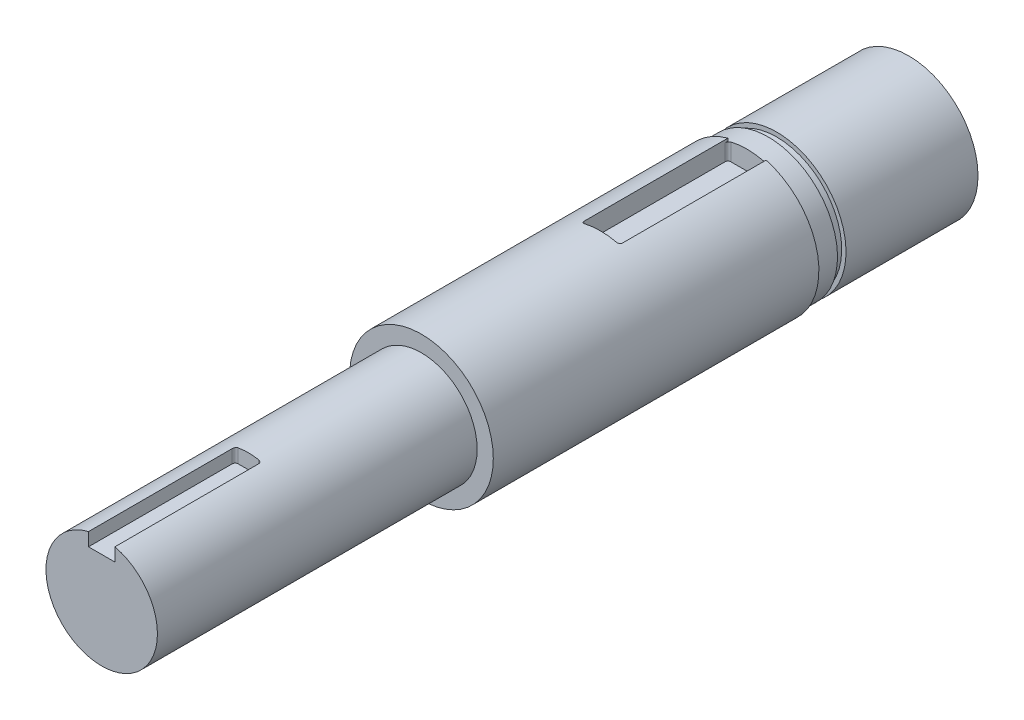
ISO-10303-21;
HEADER;
FILE_DESCRIPTION(('STEP AP214'),'2;1');
FILE_NAME('part.step','',(''),(''),'','','');
FILE_SCHEMA(('AUTOMOTIVE_DESIGN { 1 0 10303 214 1 1 1 1 }'));
ENDSEC;
DATA;
#1=APPLICATION_CONTEXT('core data for automotive mechanical design processes');
#2=APPLICATION_PROTOCOL_DEFINITION('international standard','automotive_design',2000,#1);
#3=PRODUCT_CONTEXT('',#1,'mechanical');
#4=PRODUCT('Part','Part','',(#3));
#5=PRODUCT_RELATED_PRODUCT_CATEGORY('part','',(#4));
#6=PRODUCT_DEFINITION_FORMATION('','',#4);
#7=PRODUCT_DEFINITION_CONTEXT('part definition',#1,'design');
#8=PRODUCT_DEFINITION('design','',#6,#7);
#9=PRODUCT_DEFINITION_SHAPE('','',#8);
#10=(LENGTH_UNIT() NAMED_UNIT(*) SI_UNIT(.MILLI.,.METRE.));
#11=(NAMED_UNIT(*) PLANE_ANGLE_UNIT() SI_UNIT($,.RADIAN.));
#12=(NAMED_UNIT(*) SI_UNIT($,.STERADIAN.) SOLID_ANGLE_UNIT());
#13=UNCERTAINTY_MEASURE_WITH_UNIT(LENGTH_MEASURE(1.E-05),#10,'distance_accuracy_value','');
#14=(GEOMETRIC_REPRESENTATION_CONTEXT(3) GLOBAL_UNCERTAINTY_ASSIGNED_CONTEXT((#13)) GLOBAL_UNIT_ASSIGNED_CONTEXT((#10,
#11,#12)) REPRESENTATION_CONTEXT('',''));
#15=CARTESIAN_POINT('',(0.,0.,0.));
#16=DIRECTION('',(0.,0.,1.));
#17=DIRECTION('',(1.,0.,0.));
#18=AXIS2_PLACEMENT_3D('',#15,#16,#17);
#19=CARTESIAN_POINT('',(0.,0.,28.194));
#20=DIRECTION('',(0.,0.,-1.));
#21=DIRECTION('',(-1.,0.,0.));
#22=AXIS2_PLACEMENT_3D('',#19,#20,#21);
#23=CYLINDRICAL_SURFACE('',#22,6.223);
#24=CARTESIAN_POINT('',(0.,0.,0.));
#25=DIRECTION('',(0.,0.,1.));
#26=DIRECTION('',(1.,0.,0.));
#27=AXIS2_PLACEMENT_3D('',#24,#25,#26);
#28=CIRCLE('',#27,6.223);
#29=CARTESIAN_POINT('',(-1.651,5.999993999997,0.));
#30=VERTEX_POINT('',#29);
#31=CARTESIAN_POINT('',(1.651,5.999993999997,0.));
#32=VERTEX_POINT('',#31);
#33=EDGE_CURVE('E174',#30,#32,#28,.T.);
#34=ORIENTED_EDGE('',*,*,#33,.T.);
#35=DIRECTION('',(0.,0.,-1.));
#36=VECTOR('',#35,1.);
#37=CARTESIAN_POINT('',(1.651,5.999993999997,28.194));
#38=LINE('',#37,#36);
#39=CARTESIAN_POINT('',(1.651,5.999993999997,12.446));
#40=VERTEX_POINT('',#39);
#41=EDGE_CURVE('E221',#32,#40,#38,.F.);
#42=ORIENTED_EDGE('',*,*,#41,.T.);
#43=CARTESIAN_POINT('',(1.651,5.999993999997,12.446));
#44=CARTESIAN_POINT('',(1.65101365911319,5.99998885600186,12.4599371532582));
#45=CARTESIAN_POINT('',(1.64985379408889,6.00030938344019,12.473867225153));
#46=CARTESIAN_POINT('',(1.64529192026899,6.00156258454862,12.5013011630621));
#47=CARTESIAN_POINT('',(1.64189411683366,6.00249411006495,12.514805778784));
#48=CARTESIAN_POINT('',(1.63296019772344,6.00493047717273,12.5410329475935));
#49=CARTESIAN_POINT('',(1.62742390823833,6.00643536536539,12.5537554370146));
#50=CARTESIAN_POINT('',(1.61439639075044,6.00994999603842,12.5780798810677));
#51=CARTESIAN_POINT('',(1.60690488308525,6.01195981073884,12.5896816750768));
#52=CARTESIAN_POINT('',(1.59005297817903,6.01643893737926,12.6116547380317));
#53=CARTESIAN_POINT('',(1.58066333766302,6.01891539200831,12.6220020993992));
#54=CARTESIAN_POINT('',(1.56037002430933,6.02420818200575,12.6409855630794));
#55=CARTESIAN_POINT('',(1.54946594231671,6.02702460919715,12.6496212014024));
#56=CARTESIAN_POINT('',(1.52606255784957,6.03299365715654,12.6652332823865));
#57=CARTESIAN_POINT('',(1.51352242704203,6.03615431562268,12.6721454129126));
#58=CARTESIAN_POINT('',(1.48749417753383,6.04262109166117,12.6837598850571));
#59=CARTESIAN_POINT('',(1.47400630082956,6.0459271720216,12.6884627884369));
#60=CARTESIAN_POINT('',(1.44990836609661,6.0517441617669,12.6946571828533));
#61=CARTESIAN_POINT('',(1.43942410890025,6.05424673157387,12.6966580963021));
#62=CARTESIAN_POINT('',(1.41829673705527,6.05923119850961,12.6993296549334));
#63=CARTESIAN_POINT('',(1.40765383682191,6.06171311752701,12.7000019559701));
#64=CARTESIAN_POINT('',(1.397,6.06416688424717,12.7));
#65=B_SPLINE_CURVE_WITH_KNOTS('',3,(#43,#44,#45,#46,#47,#48,#49,#50,#51,#52,#53,#54,#55,#56,#57,
#58,#59,#60,#61,#62,#63,#64),.UNSPECIFIED.,.F.,.F.,(4,2,2,2,2,2,2,2,2,2,4),(0.,
0.0417488156054148,0.0834194030451653,0.125093378067803,0.166773317150151,0.209152456981566,
0.251543068690232,0.295335507240235,0.339116804228455,0.371927199746421,0.40469667770493),.UNSPECIFIED.);
#66=CARTESIAN_POINT('',(1.397,6.06416688424717,12.7));
#67=VERTEX_POINT('',#66);
#68=EDGE_CURVE('E320',#40,#67,#65,.T.);
#69=ORIENTED_EDGE('',*,*,#68,.T.);
#70=CARTESIAN_POINT('',(0.,0.,12.7));
#71=DIRECTION('',(0.,0.,-1.));
#72=DIRECTION('',(-1.,0.,0.));
#73=AXIS2_PLACEMENT_3D('',#70,#71,#72);
#74=CIRCLE('',#73,6.223);
#75=CARTESIAN_POINT('',(-1.397,6.06416688424717,12.7));
#76=VERTEX_POINT('',#75);
#77=EDGE_CURVE('E242',#76,#67,#74,.T.);
#78=ORIENTED_EDGE('',*,*,#77,.F.);
#79=CARTESIAN_POINT('',(-1.397,6.06416688424717,12.7));
#80=CARTESIAN_POINT('',(-1.41165090529352,6.06079390642007,12.700010270971));
#81=CARTESIAN_POINT('',(-1.42628522450905,6.05736460837732,12.6987330395745));
#82=CARTESIAN_POINT('',(-1.45511557715207,6.05050247974281,12.69369188033));
#83=CARTESIAN_POINT('',(-1.46931169749558,6.04706964999295,12.6899284489764));
#84=CARTESIAN_POINT('',(-1.49687397781058,6.04030634903221,12.6800005140272));
#85=CARTESIAN_POINT('',(-1.51023969599947,6.03697593277421,12.6738347448327));
#86=CARTESIAN_POINT('',(-1.53574481264174,6.03053807691927,12.659263665385));
#87=CARTESIAN_POINT('',(-1.54788455576024,6.02743057472483,12.6508589869994));
#88=CARTESIAN_POINT('',(-1.57048207326345,6.02158206406083,12.6321017576408));
#89=CARTESIAN_POINT('',(-1.58095273326457,6.01883827849694,12.6217656175073));
#90=CARTESIAN_POINT('',(-1.59999919464336,6.0138031951122,12.5993729634366));
#91=CARTESIAN_POINT('',(-1.60857481888172,6.01151193959392,12.587316288845));
#92=CARTESIAN_POINT('',(-1.62332418480107,6.0075456300982,12.5621883274646));
#93=CARTESIAN_POINT('',(-1.62955873906087,6.00585504693318,12.549155151668));
#94=CARTESIAN_POINT('',(-1.63973781672755,6.00308395845329,12.5221690940492));
#95=CARTESIAN_POINT('',(-1.64368485486539,6.00200278323511,12.5082172410241));
#96=CARTESIAN_POINT('',(-1.64794141373288,6.00083497827377,12.4861186857271));
#97=CARTESIAN_POINT('',(-1.64908770036319,6.00051995801422,12.4781359369184));
#98=CARTESIAN_POINT('',(-1.65061671687385,6.0000994744892,12.4621034918921));
#99=CARTESIAN_POINT('',(-1.65100051257264,5.99999371871231,12.4540539049398));
#100=CARTESIAN_POINT('',(-1.65100000000012,5.99999399999709,12.446));
#101=B_SPLINE_CURVE_WITH_KNOTS('',3,(#79,#80,#81,#82,#83,#84,#85,#86,#87,#88,#89,#90,#91,#92,
#93,#94,#95,#96,#97,#98,#99,#100),.UNSPECIFIED.,.F.,.F.,(4,2,2,2,2,2,2,2,2,2,4),(0.,
0.0450436059598747,0.0900782194225987,0.135136590154682,0.180182257906668,0.224861291388814,
0.269544499498677,0.312969989332677,0.356347649301799,0.380524910361107,0.404668352327528),.UNSPECIFIED.);
#102=CARTESIAN_POINT('',(-1.651,5.999993999997,12.446));
#103=VERTEX_POINT('',#102);
#104=EDGE_CURVE('E327',#76,#103,#101,.T.);
#105=ORIENTED_EDGE('',*,*,#104,.T.);
#106=DIRECTION('',(0.,0.,-1.));
#107=VECTOR('',#106,1.);
#108=CARTESIAN_POINT('',(-1.651,5.999993999997,28.194));
#109=LINE('',#108,#107);
#110=EDGE_CURVE('E217',#103,#30,#109,.T.);
#111=ORIENTED_EDGE('',*,*,#110,.T.);
#112=EDGE_LOOP('',(#34,#42,#69,#78,#105,#111));
#113=FACE_BOUND('',#112,.T.);
#114=CARTESIAN_POINT('',(0.,0.,28.194));
#115=DIRECTION('',(0.,0.,1.));
#116=DIRECTION('',(1.,0.,0.));
#117=AXIS2_PLACEMENT_3D('',#114,#115,#116);
#118=CIRCLE('',#117,6.223);
#119=CARTESIAN_POINT('',(6.223,0.,28.194));
#120=VERTEX_POINT('',#119);
#121=EDGE_CURVE('E232',#120,#120,#118,.T.);
#122=ORIENTED_EDGE('',*,*,#121,.F.);
#123=EDGE_LOOP('',(#122));
#124=FACE_BOUND('',#123,.T.);
#125=ADVANCED_FACE('F35',(#113,#124),#23,.T.);
#126=CARTESIAN_POINT('',(0.,0.,28.194));
#127=DIRECTION('',(0.,0.,1.));
#128=DIRECTION('',(1.,0.,0.));
#129=AXIS2_PLACEMENT_3D('',#126,#127,#128);
#130=PLANE('',#129);
#131=CARTESIAN_POINT('',(0.,0.,28.194));
#132=DIRECTION('',(0.,0.,1.));
#133=DIRECTION('',(1.,0.,0.));
#134=AXIS2_PLACEMENT_3D('',#131,#132,#133);
#135=CIRCLE('',#134,4.826);
#136=CARTESIAN_POINT('',(4.826,0.,28.194));
#137=VERTEX_POINT('',#136);
#138=EDGE_CURVE('E235',#137,#137,#135,.T.);
#139=ORIENTED_EDGE('',*,*,#138,.F.);
#140=EDGE_LOOP('',(#139));
#141=FACE_BOUND('',#140,.T.);
#142=ORIENTED_EDGE('',*,*,#121,.T.);
#143=EDGE_LOOP('',(#142));
#144=FACE_BOUND('',#143,.T.);
#145=ADVANCED_FACE('F310',(#141,#144),#130,.T.);
#146=CARTESIAN_POINT('',(0.,0.,0.));
#147=DIRECTION('',(0.,0.,1.));
#148=DIRECTION('',(1.,0.,0.));
#149=AXIS2_PLACEMENT_3D('',#146,#147,#148);
#150=PLANE('',#149);
#151=CARTESIAN_POINT('',(0.,0.,0.));
#152=DIRECTION('',(0.,0.,-1.));
#153=DIRECTION('',(0.,1.,0.));
#154=AXIS2_PLACEMENT_3D('',#151,#152,#153);
#155=CIRCLE('',#154,6.);
#156=CARTESIAN_POINT('',(1.651,5.76837923510582,0.));
#157=VERTEX_POINT('',#156);
#158=CARTESIAN_POINT('',(-1.651,5.76837923510582,0.));
#159=VERTEX_POINT('',#158);
#160=EDGE_CURVE('E172',#157,#159,#155,.T.);
#161=ORIENTED_EDGE('',*,*,#160,.F.);
#162=DIRECTION('',(0.,-1.,0.));
#163=VECTOR('',#162,1.);
#164=CARTESIAN_POINT('',(1.651,7.650993999997,0.));
#165=LINE('',#164,#163);
#166=EDGE_CURVE('E207',#32,#157,#165,.T.);
#167=ORIENTED_EDGE('',*,*,#166,.F.);
#168=ORIENTED_EDGE('',*,*,#33,.F.);
#169=DIRECTION('',(0.,1.,0.));
#170=VECTOR('',#169,1.);
#171=CARTESIAN_POINT('',(-1.651,7.650993999997,0.));
#172=LINE('',#171,#170);
#173=EDGE_CURVE('E161',#159,#30,#172,.T.);
#174=ORIENTED_EDGE('',*,*,#173,.F.);
#175=EDGE_LOOP('',(#161,#167,#168,#174));
#176=FACE_BOUND('',#175,.T.);
#177=ADVANCED_FACE('F170',(#176),#150,.F.);
#178=CARTESIAN_POINT('',(0.,0.,23.114));
#179=DIRECTION('',(0.,0.,1.));
#180=DIRECTION('',(1.,0.,0.));
#181=AXIS2_PLACEMENT_3D('',#178,#179,#180);
#182=CYLINDRICAL_SURFACE('',#181,4.826);
#183=DIRECTION('',(0.,0.,1.));
#184=VECTOR('',#183,1.);
#185=CARTESIAN_POINT('',(-1.143,4.68869139526158,23.114));
#186=LINE('',#185,#184);
#187=CARTESIAN_POINT('',(-1.143,4.68869139526158,43.434));
#188=VERTEX_POINT('',#187);
#189=CARTESIAN_POINT('',(-1.143,4.68869139526158,55.88));
#190=VERTEX_POINT('',#189);
#191=EDGE_CURVE('E227',#188,#190,#186,.T.);
#192=ORIENTED_EDGE('',*,*,#191,.F.);
#193=CARTESIAN_POINT('',(-1.143,4.68869139526158,43.434));
#194=CARTESIAN_POINT('',(-1.14301334199993,4.68868635098659,43.4199846123739));
#195=CARTESIAN_POINT('',(-1.14184084717489,4.68897395076386,43.405975753492));
#196=CARTESIAN_POINT('',(-1.13722613335057,4.69009624376878,43.3783828223305));
#197=CARTESIAN_POINT('',(-1.13378773922777,4.69093001503553,43.3647980745478));
#198=CARTESIAN_POINT('',(-1.12474188821357,4.69310685198262,43.3384133417774));
#199=CARTESIAN_POINT('',(-1.11913411151888,4.69444999275197,43.3256134728165));
#200=CARTESIAN_POINT('',(-1.10592986287992,4.69757823944377,43.3011443194648));
#201=CARTESIAN_POINT('',(-1.09833320849085,4.6993633859117,43.2894751389296));
#202=CARTESIAN_POINT('',(-1.08125807646762,4.70332164743461,43.2674163947149));
#203=CARTESIAN_POINT('',(-1.07175496981913,4.70549979807583,43.2570468141734));
#204=CARTESIAN_POINT('',(-1.05120709480351,4.71013273894259,43.238038753288));
#205=CARTESIAN_POINT('',(-1.04016191879112,4.71258760228383,43.2294007321565));
#206=CARTESIAN_POINT('',(-1.01653324617878,4.71774161161798,43.2138721370442));
#207=CARTESIAN_POINT('',(-1.00391749021795,4.72044541666509,43.207032222388));
#208=CARTESIAN_POINT('',(-0.977733886753047,4.72593811465772,43.1955753445258));
#209=CARTESIAN_POINT('',(-0.964166399743517,4.72872697516229,43.1909575447861));
#210=CARTESIAN_POINT('',(-0.940294692147358,4.73352155502814,43.1850189642204));
#211=CARTESIAN_POINT('',(-0.930126380668296,4.73553043040085,43.1831394348262));
#212=CARTESIAN_POINT('',(-0.909642261587015,4.73950810987208,43.1806298297939));
#213=CARTESIAN_POINT('',(-0.899326650364549,4.74147696013265,43.179998223232));
#214=CARTESIAN_POINT('',(-0.889000000000001,4.74341174683371,43.18));
#215=B_SPLINE_CURVE_WITH_KNOTS('',3,(#193,#194,#195,#196,#197,#198,#199,#200,#201,#202,#203,
#204,#205,#206,#207,#208,#209,#210,#211,#212,#213,#214),.UNSPECIFIED.,.F.,.F.,(4,2,2,2,2,2,2,2,
2,2,4),(0.,0.0419843682672591,0.0838980471205153,0.125817907107391,0.167741613857442,
0.210246540180535,0.252762724010073,0.296372439099527,0.339965724075916,0.371495834097339,
0.402987239611668),.UNSPECIFIED.);
#216=CARTESIAN_POINT('',(-0.889,4.74341174683371,43.18));
#217=VERTEX_POINT('',#216);
#218=EDGE_CURVE('E292',#188,#217,#215,.T.);
#219=ORIENTED_EDGE('',*,*,#218,.T.);
#220=CARTESIAN_POINT('',(0.,0.,43.18));
#221=DIRECTION('',(0.,0.,1.));
#222=DIRECTION('',(1.,0.,0.));
#223=AXIS2_PLACEMENT_3D('',#220,#221,#222);
#224=CIRCLE('',#223,4.826);
#225=CARTESIAN_POINT('',(0.888999999999998,4.74341174683371,43.18));
#226=VERTEX_POINT('',#225);
#227=EDGE_CURVE('E239',#217,#226,#224,.F.);
#228=ORIENTED_EDGE('',*,*,#227,.T.);
#229=CARTESIAN_POINT('',(0.888999999999999,4.74341174683371,43.18));
#230=CARTESIAN_POINT('',(0.903555798587623,4.74068638777175,43.1799892578155));
#231=CARTESIAN_POINT('',(0.918093737937157,4.73788978716182,43.1812504980773));
#232=CARTESIAN_POINT('',(0.946727866834993,4.73224983111499,43.1862237678369));
#233=CARTESIAN_POINT('',(0.960824269882662,4.72940649932109,43.1899345930906));
#234=CARTESIAN_POINT('',(0.988190183015704,4.72376474974196,43.1997161022364));
#235=CARTESIAN_POINT('',(1.00145933976523,4.72096635152266,43.2057877866006));
#236=CARTESIAN_POINT('',(1.0267862384559,4.71552260758907,43.2201249475353));
#237=CARTESIAN_POINT('',(1.03884422030326,4.71287723160874,43.2283899884658));
#238=CARTESIAN_POINT('',(1.06136001677871,4.70785767398695,43.2468652701789));
#239=CARTESIAN_POINT('',(1.07182313940201,4.70548259972833,43.2570687927509));
#240=CARTESIAN_POINT('',(1.09088006809683,4.7011012029268,43.2791670709734));
#241=CARTESIAN_POINT('',(1.09947365206943,4.69909492420072,43.2910620272868));
#242=CARTESIAN_POINT('',(1.11436196885179,4.69558632941763,43.3159563840189));
#243=CARTESIAN_POINT('',(1.1206985671218,4.69407488273329,43.328929480214));
#244=CARTESIAN_POINT('',(1.13109071436929,4.69158167588256,43.3558009981252));
#245=CARTESIAN_POINT('',(1.13514849056194,4.69059939856892,43.3696985014545));
#246=CARTESIAN_POINT('',(1.13966079538133,4.68950445925056,43.3920925612066));
#247=CARTESIAN_POINT('',(1.14091217876535,4.68919999716804,43.4004274008301));
#248=CARTESIAN_POINT('',(1.14258156455197,4.68879340919531,43.4171734374529));
#249=CARTESIAN_POINT('',(1.14300070513798,4.68869100696727,43.4255845143425));
#250=CARTESIAN_POINT('',(1.14300000000019,4.68869139526177,43.434));
#251=B_SPLINE_CURVE_WITH_KNOTS('',3,(#229,#230,#231,#232,#233,#234,#235,#236,#237,#238,#239,
#240,#241,#242,#243,#244,#245,#246,#247,#248,#249,#250),.UNSPECIFIED.,.F.,.F.,(4,2,2,2,2,2,2,2,
2,2,4),(0.,0.0443663541566462,0.0887109135318685,0.133074285522301,0.177428852736762,
0.221632415253622,0.26584122623593,0.30918108135022,0.35247850404924,0.377739886298249,
0.402966696972388),.UNSPECIFIED.);
#252=CARTESIAN_POINT('',(1.143,4.68869139526158,43.434));
#253=VERTEX_POINT('',#252);
#254=EDGE_CURVE('E284',#226,#253,#251,.T.);
#255=ORIENTED_EDGE('',*,*,#254,.T.);
#256=DIRECTION('',(0.,0.,1.));
#257=VECTOR('',#256,1.);
#258=CARTESIAN_POINT('',(1.143,4.68869139526158,23.114));
#259=LINE('',#258,#257);
#260=CARTESIAN_POINT('',(1.143,4.68869139526158,55.88));
#261=VERTEX_POINT('',#260);
#262=EDGE_CURVE('E224',#261,#253,#259,.F.);
#263=ORIENTED_EDGE('',*,*,#262,.F.);
#264=CARTESIAN_POINT('',(0.,0.,55.88));
#265=DIRECTION('',(0.,0.,1.));
#266=DIRECTION('',(1.,0.,0.));
#267=AXIS2_PLACEMENT_3D('',#264,#265,#266);
#268=CIRCLE('',#267,4.826);
#269=EDGE_CURVE('E229',#190,#261,#268,.T.);
#270=ORIENTED_EDGE('',*,*,#269,.F.);
#271=EDGE_LOOP('',(#192,#219,#228,#255,#263,#270));
#272=FACE_BOUND('',#271,.T.);
#273=ORIENTED_EDGE('',*,*,#138,.T.);
#274=EDGE_LOOP('',(#273));
#275=FACE_BOUND('',#274,.T.);
#276=ADVANCED_FACE('F302',(#272,#275),#182,.T.);
#277=CARTESIAN_POINT('',(0.,0.,55.88));
#278=DIRECTION('',(0.,0.,1.));
#279=DIRECTION('',(1.,0.,0.));
#280=AXIS2_PLACEMENT_3D('',#277,#278,#279);
#281=PLANE('',#280);
#282=DIRECTION('',(0.,-1.,0.));
#283=VECTOR('',#282,1.);
#284=CARTESIAN_POINT('',(-1.143,5.83169139526158,55.88));
#285=LINE('',#284,#283);
#286=CARTESIAN_POINT('',(-1.143,3.54569139526158,55.88));
#287=VERTEX_POINT('',#286);
#288=EDGE_CURVE('E183',#190,#287,#285,.T.);
#289=ORIENTED_EDGE('',*,*,#288,.F.);
#290=ORIENTED_EDGE('',*,*,#269,.T.);
#291=DIRECTION('',(0.,1.,0.));
#292=VECTOR('',#291,1.);
#293=CARTESIAN_POINT('',(1.143,5.83169139526158,55.88));
#294=LINE('',#293,#292);
#295=CARTESIAN_POINT('',(1.143,3.54569139526158,55.88));
#296=VERTEX_POINT('',#295);
#297=EDGE_CURVE('E198',#296,#261,#294,.T.);
#298=ORIENTED_EDGE('',*,*,#297,.F.);
#299=DIRECTION('',(1.,0.,0.));
#300=VECTOR('',#299,1.);
#301=CARTESIAN_POINT('',(-1.143,3.54569139526158,55.88));
#302=LINE('',#301,#300);
#303=EDGE_CURVE('E201',#287,#296,#302,.T.);
#304=ORIENTED_EDGE('',*,*,#303,.F.);
#305=EDGE_LOOP('',(#289,#290,#298,#304));
#306=FACE_BOUND('',#305,.T.);
#307=ADVANCED_FACE('F307',(#306),#281,.T.);
#308=CARTESIAN_POINT('',(0.,0.,12.7));
#309=DIRECTION('',(0.,0.,-1.));
#310=DIRECTION('',(-1.,0.,0.));
#311=AXIS2_PLACEMENT_3D('',#308,#309,#310);
#312=PLANE('',#311);
#313=ORIENTED_EDGE('',*,*,#77,.T.);
#314=DIRECTION('',(0.,-1.,0.));
#315=VECTOR('',#314,1.);
#316=CARTESIAN_POINT('',(1.397,0.,12.7));
#317=LINE('',#316,#315);
#318=CARTESIAN_POINT('',(1.397,4.348993999997,12.7));
#319=VERTEX_POINT('',#318);
#320=EDGE_CURVE('E262',#67,#319,#317,.T.);
#321=ORIENTED_EDGE('',*,*,#320,.T.);
#322=DIRECTION('',(-1.,0.,0.));
#323=VECTOR('',#322,1.);
#324=CARTESIAN_POINT('',(1.651,4.348993999997,12.7));
#325=LINE('',#324,#323);
#326=CARTESIAN_POINT('',(-1.397,4.348993999997,12.7));
#327=VERTEX_POINT('',#326);
#328=EDGE_CURVE('E175',#319,#327,#325,.T.);
#329=ORIENTED_EDGE('',*,*,#328,.T.);
#330=DIRECTION('',(0.,1.,0.));
#331=VECTOR('',#330,1.);
#332=CARTESIAN_POINT('',(-1.397,0.,12.7));
#333=LINE('',#332,#331);
#334=EDGE_CURVE('E259',#327,#76,#333,.T.);
#335=ORIENTED_EDGE('',*,*,#334,.T.);
#336=EDGE_LOOP('',(#313,#321,#329,#335));
#337=FACE_BOUND('',#336,.T.);
#338=ADVANCED_FACE('F367',(#337),#312,.T.);
#339=CARTESIAN_POINT('',(1.651,7.650993999997,12.7));
#340=DIRECTION('',(1.,0.,0.));
#341=DIRECTION('',(0.,0.,-1.));
#342=AXIS2_PLACEMENT_3D('',#339,#340,#341);
#343=PLANE('',#342);
#344=DIRECTION('',(0.,0.,-1.));
#345=VECTOR('',#344,1.);
#346=CARTESIAN_POINT('',(1.651,4.348993999997,12.7));
#347=LINE('',#346,#345);
#348=CARTESIAN_POINT('',(1.651,4.348993999997,12.446));
#349=VERTEX_POINT('',#348);
#350=CARTESIAN_POINT('',(1.651,4.348993999997,0.254000000000046));
#351=VERTEX_POINT('',#350);
#352=EDGE_CURVE('E211',#349,#351,#347,.T.);
#353=ORIENTED_EDGE('',*,*,#352,.F.);
#354=DIRECTION('',(0.,-1.,0.));
#355=VECTOR('',#354,1.);
#356=CARTESIAN_POINT('',(1.651,7.650993999997,12.446));
#357=LINE('',#356,#355);
#358=EDGE_CURVE('E166',#349,#40,#357,.F.);
#359=ORIENTED_EDGE('',*,*,#358,.T.);
#360=ORIENTED_EDGE('',*,*,#41,.F.);
#361=ORIENTED_EDGE('',*,*,#166,.T.);
#362=DIRECTION('',(0.,0.,1.));
#363=VECTOR('',#362,1.);
#364=CARTESIAN_POINT('',(1.651,5.76837923510582,0.));
#365=LINE('',#364,#363);
#366=CARTESIAN_POINT('',(1.651,5.76837923510582,0.254000000000061));
#367=VERTEX_POINT('',#366);
#368=EDGE_CURVE('E56',#157,#367,#365,.T.);
#369=ORIENTED_EDGE('',*,*,#368,.T.);
#370=DIRECTION('',(0.,-1.,0.));
#371=VECTOR('',#370,1.);
#372=CARTESIAN_POINT('',(1.651,4.348993999997,0.254000000000046));
#373=LINE('',#372,#371);
#374=EDGE_CURVE('E274',#367,#351,#373,.T.);
#375=ORIENTED_EDGE('',*,*,#374,.T.);
#376=EDGE_LOOP('',(#353,#359,#360,#361,#369,#375));
#377=FACE_BOUND('',#376,.T.);
#378=ADVANCED_FACE('F355',(#377),#343,.F.);
#379=CARTESIAN_POINT('',(-1.651,7.650993999997,12.7));
#380=DIRECTION('',(-1.,0.,0.));
#381=DIRECTION('',(0.,-1.,0.));
#382=AXIS2_PLACEMENT_3D('',#379,#380,#381);
#383=PLANE('',#382);
#384=ORIENTED_EDGE('',*,*,#110,.F.);
#385=DIRECTION('',(0.,1.,0.));
#386=VECTOR('',#385,1.);
#387=CARTESIAN_POINT('',(-1.651,7.650993999997,12.446));
#388=LINE('',#387,#386);
#389=CARTESIAN_POINT('',(-1.651,4.348993999997,12.446));
#390=VERTEX_POINT('',#389);
#391=EDGE_CURVE('E279',#103,#390,#388,.F.);
#392=ORIENTED_EDGE('',*,*,#391,.T.);
#393=DIRECTION('',(0.,0.,-1.));
#394=VECTOR('',#393,1.);
#395=CARTESIAN_POINT('',(-1.651,4.348993999997,12.7));
#396=LINE('',#395,#394);
#397=CARTESIAN_POINT('',(-1.651,4.348993999997,0.254000000000046));
#398=VERTEX_POINT('',#397);
#399=EDGE_CURVE('E215',#390,#398,#396,.T.);
#400=ORIENTED_EDGE('',*,*,#399,.T.);
#401=DIRECTION('',(0.,1.,0.));
#402=VECTOR('',#401,1.);
#403=CARTESIAN_POINT('',(-1.651,5.76837923510582,0.254000000000061));
#404=LINE('',#403,#402);
#405=CARTESIAN_POINT('',(-1.651,5.76837923510582,0.254000000000061));
#406=VERTEX_POINT('',#405);
#407=EDGE_CURVE('E165',#398,#406,#404,.T.);
#408=ORIENTED_EDGE('',*,*,#407,.T.);
#409=DIRECTION('',(0.,0.,1.));
#410=VECTOR('',#409,1.);
#411=CARTESIAN_POINT('',(-1.651,5.76837923510582,0.254000000000061));
#412=LINE('',#411,#410);
#413=EDGE_CURVE('E157',#406,#159,#412,.F.);
#414=ORIENTED_EDGE('',*,*,#413,.T.);
#415=ORIENTED_EDGE('',*,*,#173,.T.);
#416=EDGE_LOOP('',(#384,#392,#400,#408,#414,#415));
#417=FACE_BOUND('',#416,.T.);
#418=ADVANCED_FACE('F160',(#417),#383,.F.);
#419=CARTESIAN_POINT('',(1.651,4.348993999997,12.7));
#420=DIRECTION('',(0.,-1.,0.));
#421=DIRECTION('',(1.,0.,0.));
#422=AXIS2_PLACEMENT_3D('',#419,#420,#421);
#423=PLANE('',#422);
#424=ORIENTED_EDGE('',*,*,#328,.F.);
#425=CARTESIAN_POINT('',(1.397,4.348993999997,12.446));
#426=DIRECTION('',(0.,-1.,0.));
#427=DIRECTION('',(1.,0.,0.));
#428=AXIS2_PLACEMENT_3D('',#425,#426,#427);
#429=CIRCLE('',#428,0.254);
#430=EDGE_CURVE('E271',#319,#349,#429,.F.);
#431=ORIENTED_EDGE('',*,*,#430,.T.);
#432=ORIENTED_EDGE('',*,*,#352,.T.);
#433=CARTESIAN_POINT('',(1.397,4.348993999997,0.254000000000046));
#434=DIRECTION('',(0.,-1.,0.));
#435=DIRECTION('',(1.,0.,0.));
#436=AXIS2_PLACEMENT_3D('',#433,#434,#435);
#437=CIRCLE('',#436,0.254);
#438=CARTESIAN_POINT('',(1.397,4.348993999997,0.));
#439=VERTEX_POINT('',#438);
#440=EDGE_CURVE('E267',#351,#439,#437,.F.);
#441=ORIENTED_EDGE('',*,*,#440,.T.);
#442=DIRECTION('',(-1.,0.,0.));
#443=VECTOR('',#442,1.);
#444=CARTESIAN_POINT('',(1.651,4.348993999997,0.));
#445=LINE('',#444,#443);
#446=CARTESIAN_POINT('',(-1.397,4.348993999997,0.));
#447=VERTEX_POINT('',#446);
#448=EDGE_CURVE('E176',#439,#447,#445,.T.);
#449=ORIENTED_EDGE('',*,*,#448,.T.);
#450=CARTESIAN_POINT('',(-1.397,4.348993999997,0.254000000000046));
#451=DIRECTION('',(0.,-1.,0.));
#452=DIRECTION('',(1.,0.,0.));
#453=AXIS2_PLACEMENT_3D('',#450,#451,#452);
#454=CIRCLE('',#453,0.254);
#455=EDGE_CURVE('E265',#447,#398,#454,.F.);
#456=ORIENTED_EDGE('',*,*,#455,.T.);
#457=ORIENTED_EDGE('',*,*,#399,.F.);
#458=CARTESIAN_POINT('',(-1.397,4.348993999997,12.446));
#459=DIRECTION('',(0.,-1.,0.));
#460=DIRECTION('',(1.,0.,0.));
#461=AXIS2_PLACEMENT_3D('',#458,#459,#460);
#462=CIRCLE('',#461,0.254);
#463=EDGE_CURVE('E269',#390,#327,#462,.F.);
#464=ORIENTED_EDGE('',*,*,#463,.T.);
#465=EDGE_LOOP('',(#424,#431,#432,#441,#449,#456,#457,#464));
#466=FACE_BOUND('',#465,.T.);
#467=ADVANCED_FACE('F365',(#466),#423,.F.);
#468=CARTESIAN_POINT('',(-1.143,5.83169139526158,43.18));
#469=DIRECTION('',(-1.,0.,0.));
#470=DIRECTION('',(0.,0.,1.));
#471=AXIS2_PLACEMENT_3D('',#468,#469,#470);
#472=PLANE('',#471);
#473=DIRECTION('',(0.,0.,1.));
#474=VECTOR('',#473,1.);
#475=CARTESIAN_POINT('',(-1.143,3.54569139526158,43.18));
#476=LINE('',#475,#474);
#477=CARTESIAN_POINT('',(-1.143,3.54569139526158,43.434));
#478=VERTEX_POINT('',#477);
#479=EDGE_CURVE('E197',#478,#287,#476,.T.);
#480=ORIENTED_EDGE('',*,*,#479,.F.);
#481=DIRECTION('',(0.,-1.,0.));
#482=VECTOR('',#481,1.);
#483=CARTESIAN_POINT('',(-1.143,5.83169139526158,43.434));
#484=LINE('',#483,#482);
#485=EDGE_CURVE('E257',#478,#188,#484,.F.);
#486=ORIENTED_EDGE('',*,*,#485,.T.);
#487=ORIENTED_EDGE('',*,*,#191,.T.);
#488=ORIENTED_EDGE('',*,*,#288,.T.);
#489=EDGE_LOOP('',(#480,#486,#487,#488));
#490=FACE_BOUND('',#489,.T.);
#491=ADVANCED_FACE('F401',(#490),#472,.F.);
#492=CARTESIAN_POINT('',(1.143,5.83169139526158,43.18));
#493=DIRECTION('',(1.,0.,0.));
#494=DIRECTION('',(0.,1.,0.));
#495=AXIS2_PLACEMENT_3D('',#492,#493,#494);
#496=PLANE('',#495);
#497=ORIENTED_EDGE('',*,*,#262,.T.);
#498=DIRECTION('',(0.,1.,0.));
#499=VECTOR('',#498,1.);
#500=CARTESIAN_POINT('',(1.143,5.83169139526158,43.434));
#501=LINE('',#500,#499);
#502=CARTESIAN_POINT('',(1.143,3.54569139526158,43.434));
#503=VERTEX_POINT('',#502);
#504=EDGE_CURVE('E251',#253,#503,#501,.F.);
#505=ORIENTED_EDGE('',*,*,#504,.T.);
#506=DIRECTION('',(0.,0.,1.));
#507=VECTOR('',#506,1.);
#508=CARTESIAN_POINT('',(1.143,3.54569139526158,43.18));
#509=LINE('',#508,#507);
#510=EDGE_CURVE('E205',#503,#296,#509,.T.);
#511=ORIENTED_EDGE('',*,*,#510,.T.);
#512=ORIENTED_EDGE('',*,*,#297,.T.);
#513=EDGE_LOOP('',(#497,#505,#511,#512));
#514=FACE_BOUND('',#513,.T.);
#515=ADVANCED_FACE('F398',(#514),#496,.F.);
#516=CARTESIAN_POINT('',(-1.143,3.54569139526158,43.18));
#517=DIRECTION('',(0.,-1.,0.));
#518=DIRECTION('',(0.,0.,-1.));
#519=AXIS2_PLACEMENT_3D('',#516,#517,#518);
#520=PLANE('',#519);
#521=ORIENTED_EDGE('',*,*,#510,.F.);
#522=CARTESIAN_POINT('',(0.888999999999999,3.54569139526158,43.434));
#523=DIRECTION('',(0.,-1.,0.));
#524=DIRECTION('',(0.,0.,-1.));
#525=AXIS2_PLACEMENT_3D('',#522,#523,#524);
#526=CIRCLE('',#525,0.254);
#527=CARTESIAN_POINT('',(0.889,3.54569139526158,43.18));
#528=VERTEX_POINT('',#527);
#529=EDGE_CURVE('E255',#503,#528,#526,.F.);
#530=ORIENTED_EDGE('',*,*,#529,.T.);
#531=DIRECTION('',(1.,0.,0.));
#532=VECTOR('',#531,1.);
#533=CARTESIAN_POINT('',(-1.143,3.54569139526158,43.18));
#534=LINE('',#533,#532);
#535=CARTESIAN_POINT('',(-0.889,3.54569139526158,43.18));
#536=VERTEX_POINT('',#535);
#537=EDGE_CURVE('E194',#536,#528,#534,.T.);
#538=ORIENTED_EDGE('',*,*,#537,.F.);
#539=CARTESIAN_POINT('',(-0.889,3.54569139526158,43.434));
#540=DIRECTION('',(0.,-1.,0.));
#541=DIRECTION('',(0.,0.,-1.));
#542=AXIS2_PLACEMENT_3D('',#539,#540,#541);
#543=CIRCLE('',#542,0.254);
#544=EDGE_CURVE('E253',#536,#478,#543,.F.);
#545=ORIENTED_EDGE('',*,*,#544,.T.);
#546=ORIENTED_EDGE('',*,*,#479,.T.);
#547=ORIENTED_EDGE('',*,*,#303,.T.);
#548=EDGE_LOOP('',(#521,#530,#538,#545,#546,#547));
#549=FACE_BOUND('',#548,.T.);
#550=ADVANCED_FACE('F396',(#549),#520,.F.);
#551=CARTESIAN_POINT('',(0.,0.,43.18));
#552=DIRECTION('',(0.,0.,1.));
#553=DIRECTION('',(1.,0.,0.));
#554=AXIS2_PLACEMENT_3D('',#551,#552,#553);
#555=PLANE('',#554);
#556=ORIENTED_EDGE('',*,*,#537,.T.);
#557=DIRECTION('',(0.,1.,0.));
#558=VECTOR('',#557,1.);
#559=CARTESIAN_POINT('',(0.889000000000002,0.,43.18));
#560=LINE('',#559,#558);
#561=EDGE_CURVE('E248',#528,#226,#560,.T.);
#562=ORIENTED_EDGE('',*,*,#561,.T.);
#563=ORIENTED_EDGE('',*,*,#227,.F.);
#564=DIRECTION('',(0.,-1.,0.));
#565=VECTOR('',#564,1.);
#566=CARTESIAN_POINT('',(-0.889,0.,43.18));
#567=LINE('',#566,#565);
#568=EDGE_CURVE('E245',#217,#536,#567,.T.);
#569=ORIENTED_EDGE('',*,*,#568,.T.);
#570=EDGE_LOOP('',(#556,#562,#563,#569));
#571=FACE_BOUND('',#570,.T.);
#572=ADVANCED_FACE('F385',(#571),#555,.T.);
#573=CARTESIAN_POINT('',(0.,1.46642216231412E-13,-14.));
#574=DIRECTION('',(0.,0.,1.));
#575=DIRECTION('',(0.,-1.,0.));
#576=AXIS2_PLACEMENT_3D('',#573,#574,#575);
#577=CYLINDRICAL_SURFACE('',#576,6.);
#578=CARTESIAN_POINT('',(0.,0.,-1.8334));
#579=DIRECTION('',(0.,0.,1.));
#580=DIRECTION('',(0.,-1.,0.));
#581=AXIS2_PLACEMENT_3D('',#578,#579,#580);
#582=CIRCLE('',#581,6.);
#583=CARTESIAN_POINT('',(0.,-5.99999999999998,-1.83340000000006));
#584=VERTEX_POINT('',#583);
#585=EDGE_CURVE('E185',#584,#584,#582,.T.);
#586=ORIENTED_EDGE('',*,*,#585,.T.);
#587=EDGE_LOOP('',(#586));
#588=FACE_BOUND('',#587,.T.);
#589=ORIENTED_EDGE('',*,*,#160,.T.);
#590=ORIENTED_EDGE('',*,*,#413,.F.);
#591=CARTESIAN_POINT('',(-1.651,5.76837923510582,0.254000000000061));
#592=CARTESIAN_POINT('',(-1.65101376688851,5.76837385899415,0.240089923334451));
#593=CARTESIAN_POINT('',(-1.64985825930497,5.76870600466579,0.226187192860184));
#594=CARTESIAN_POINT('',(-1.64531470153301,5.77000428602704,0.198808761602546));
#595=CARTESIAN_POINT('',(-1.64193102166331,5.77096918063274,0.185332278899227));
#596=CARTESIAN_POINT('',(-1.63303615394639,5.77349226191792,0.159160607978458));
#597=CARTESIAN_POINT('',(-1.62752485907568,5.77505047844267,0.146465459100993));
#598=CARTESIAN_POINT('',(-1.61455891612553,5.77868886426919,0.122191836004422));
#599=CARTESIAN_POINT('',(-1.60710394346588,5.7807691207457,0.110613548736001));
#600=CARTESIAN_POINT('',(-1.59032697919811,5.78540723566566,0.0886672373299314));
#601=CARTESIAN_POINT('',(-1.58097374714299,5.78797302941505,0.0783247997101306));
#602=CARTESIAN_POINT('',(-1.56076048868596,5.79345632932232,0.0593444005056333));
#603=CARTESIAN_POINT('',(-1.54990004853658,5.79637393202721,0.0507069085323471));
#604=CARTESIAN_POINT('',(-1.52656119988887,5.80256508625676,0.0350610624227392));
#605=CARTESIAN_POINT('',(-1.5140389273704,5.8058476168945,0.0281217279892727));
#606=CARTESIAN_POINT('',(-1.48804428329497,5.81256433985563,0.0164504162626238));
#607=CARTESIAN_POINT('',(-1.4745721299958,5.8159984972718,0.0117179337830066));
#608=CARTESIAN_POINT('',(-1.45039748953997,5.82206683713253,0.00544311546295078));
#609=CARTESIAN_POINT('',(-1.43981861172329,5.824692372028,0.00340475889390884));
#610=CARTESIAN_POINT('',(-1.41849687873235,5.82992184522095,0.000683029232247951));
#611=CARTESIAN_POINT('',(-1.40775424203564,5.83252580617221,-2.01295127835714E-06));
#612=CARTESIAN_POINT('',(-1.397,5.83509991345478,0.));
#613=B_SPLINE_CURVE_WITH_KNOTS('',3,(#591,#592,#593,#594,#595,#596,#597,#598,#599,#600,#601,
#602,#603,#604,#605,#606,#607,#608,#609,#610,#611,#612),.UNSPECIFIED.,.F.,.F.,(4,2,2,2,2,2,2,2,
2,2,4),(0.,0.0416671468028204,0.0832528104638378,0.124840566243687,0.166435271332729,
0.208779969674462,0.251136315243538,0.29500197312616,0.338857584468504,0.372043282190441,
0.405188025191536),.UNSPECIFIED.);
#614=CARTESIAN_POINT('',(-1.397,5.83509991345478,0.));
#615=VERTEX_POINT('',#614);
#616=EDGE_CURVE('E11',#406,#615,#613,.T.);
#617=ORIENTED_EDGE('',*,*,#616,.T.);
#618=CARTESIAN_POINT('',(1.397,5.83509991345478,0.));
#619=VERTEX_POINT('',#618);
#620=EDGE_CURVE('E180',#615,#619,#155,.T.);
#621=ORIENTED_EDGE('',*,*,#620,.T.);
#622=CARTESIAN_POINT('',(1.397,5.83509991345478,0.));
#623=CARTESIAN_POINT('',(1.41168005202716,5.83158756265605,-1.01121972218035E-05));
#624=CARTESIAN_POINT('',(1.426342418772,5.82801644337592,0.0012720150917043));
#625=CARTESIAN_POINT('',(1.45522688614268,5.82087012761101,0.00633252400772599));
#626=CARTESIAN_POINT('',(1.46944905379564,5.81729493183376,0.0101105236226998));
#627=CARTESIAN_POINT('',(1.49706029096749,5.81025091024582,0.0200772471225306));
#628=CARTESIAN_POINT('',(1.51044891437681,5.80678214188984,0.0262672492546397));
#629=CARTESIAN_POINT('',(1.53599541367031,5.80007690598006,0.040897337770842));
#630=CARTESIAN_POINT('',(1.54815364487477,5.79684037143935,0.0493367719769722));
#631=CARTESIAN_POINT('',(1.57077360300867,5.79075182133764,0.0681682856924481));
#632=CARTESIAN_POINT('',(1.58124933665287,5.78789666844664,0.0785425014254108));
#633=CARTESIAN_POINT('',(1.60029825452638,5.78265884652916,0.101020496168707));
#634=CARTESIAN_POINT('',(1.60887128017487,5.78027621688678,0.113124419203052));
#635=CARTESIAN_POINT('',(1.62358678273083,5.77615986488363,0.138323985359229));
#636=CARTESIAN_POINT('',(1.62979526885433,5.77440860622011,0.151378254964697));
#637=CARTESIAN_POINT('',(1.63991820422869,5.77154193104013,0.17840644642848));
#638=CARTESIAN_POINT('',(1.64383526932968,5.77042578952381,0.19237929928778));
#639=CARTESIAN_POINT('',(1.64802011452032,5.76923148442175,0.214397859338795));
#640=CARTESIAN_POINT('',(1.64913691359821,5.768912236904,0.222278757032698));
#641=CARTESIAN_POINT('',(1.65062656926735,5.7684861250279,0.238105074270171));
#642=CARTESIAN_POINT('',(1.65100046429985,5.76837896421273,0.246050388140525));
#643=CARTESIAN_POINT('',(1.65100000000009,5.7683792351059,0.254000000000047));
#644=B_SPLINE_CURVE_WITH_KNOTS('',3,(#622,#623,#624,#625,#626,#627,#628,#629,#630,#631,#632,
#633,#634,#635,#636,#637,#638,#639,#640,#641,#642,#643),.UNSPECIFIED.,.F.,.F.,(4,2,2,2,2,2,2,2,
2,2,4),(0.,0.0452241178523169,0.0904413154148079,0.135682508615404,0.180910599275498,
0.225740102710843,0.270573341050337,0.314042630177599,0.357462198117964,0.381326500652907,
0.405157421812179),.UNSPECIFIED.);
#645=EDGE_CURVE('E49',#619,#367,#644,.T.);
#646=ORIENTED_EDGE('',*,*,#645,.T.);
#647=ORIENTED_EDGE('',*,*,#368,.F.);
#648=EDGE_LOOP('',(#589,#590,#617,#621,#646,#647));
#649=FACE_BOUND('',#648,.T.);
#650=ADVANCED_FACE('F178',(#588,#649),#577,.T.);
#651=CARTESIAN_POINT('',(0.,0.,0.));
#652=DIRECTION('',(0.,0.,-1.));
#653=DIRECTION('',(0.,1.,0.));
#654=AXIS2_PLACEMENT_3D('',#651,#652,#653);
#655=PLANE('',#654);
#656=ORIENTED_EDGE('',*,*,#448,.F.);
#657=DIRECTION('',(0.,-1.,0.));
#658=VECTOR('',#657,1.);
#659=CARTESIAN_POINT('',(1.397,5.76837923510582,0.));
#660=LINE('',#659,#658);
#661=EDGE_CURVE('E64',#439,#619,#660,.F.);
#662=ORIENTED_EDGE('',*,*,#661,.T.);
#663=ORIENTED_EDGE('',*,*,#620,.F.);
#664=DIRECTION('',(0.,1.,0.));
#665=VECTOR('',#664,1.);
#666=CARTESIAN_POINT('',(-1.397,4.348993999997,0.));
#667=LINE('',#666,#665);
#668=EDGE_CURVE('E281',#615,#447,#667,.F.);
#669=ORIENTED_EDGE('',*,*,#668,.T.);
#670=EDGE_LOOP('',(#656,#662,#663,#669));
#671=FACE_BOUND('',#670,.T.);
#672=ADVANCED_FACE('F372',(#671),#655,.F.);
#673=CARTESIAN_POINT('',(0.,0.,-1.8334));
#674=DIRECTION('',(0.,0.,1.));
#675=DIRECTION('',(0.,-1.,0.));
#676=AXIS2_PLACEMENT_3D('',#673,#674,#675);
#677=PLANE('',#676);
#678=CARTESIAN_POINT('',(0.,0.,-1.8334));
#679=DIRECTION('',(0.,0.,-1.));
#680=DIRECTION('',(0.,1.,0.));
#681=AXIS2_PLACEMENT_3D('',#678,#679,#680);
#682=CIRCLE('',#681,5.6261);
#683=CARTESIAN_POINT('',(0.,5.62610000000002,-1.83339999999994));
#684=VERTEX_POINT('',#683);
#685=EDGE_CURVE('E191',#684,#684,#682,.T.);
#686=ORIENTED_EDGE('',*,*,#685,.F.);
#687=EDGE_LOOP('',(#686));
#688=FACE_BOUND('',#687,.T.);
#689=ORIENTED_EDGE('',*,*,#585,.F.);
#690=EDGE_LOOP('',(#689));
#691=FACE_BOUND('',#690,.T.);
#692=ADVANCED_FACE('F375',(#688,#691),#677,.F.);
#693=CARTESIAN_POINT('',(0.,0.,-2.57));
#694=DIRECTION('',(0.,0.,1.));
#695=DIRECTION('',(0.,-1.,0.));
#696=AXIS2_PLACEMENT_3D('',#693,#694,#695);
#697=PLANE('',#696);
#698=CARTESIAN_POINT('',(0.,0.,-2.57));
#699=DIRECTION('',(0.,0.,-1.));
#700=DIRECTION('',(0.,1.,0.));
#701=AXIS2_PLACEMENT_3D('',#698,#699,#700);
#702=CIRCLE('',#701,5.6261);
#703=CARTESIAN_POINT('',(0.,5.62610000000003,-2.56999999999994));
#704=VERTEX_POINT('',#703);
#705=EDGE_CURVE('E625',#704,#704,#702,.T.);
#706=ORIENTED_EDGE('',*,*,#705,.T.);
#707=EDGE_LOOP('',(#706));
#708=FACE_BOUND('',#707,.T.);
#709=CARTESIAN_POINT('',(0.,0.,-2.57));
#710=DIRECTION('',(0.,0.,1.));
#711=DIRECTION('',(0.,-1.,0.));
#712=AXIS2_PLACEMENT_3D('',#709,#710,#711);
#713=CIRCLE('',#712,6.);
#714=CARTESIAN_POINT('',(0.,-5.99999999999997,-2.57000000000006));
#715=VERTEX_POINT('',#714);
#716=EDGE_CURVE('E188',#715,#715,#713,.T.);
#717=ORIENTED_EDGE('',*,*,#716,.T.);
#718=EDGE_LOOP('',(#717));
#719=FACE_BOUND('',#718,.T.);
#720=ADVANCED_FACE('F382',(#708,#719),#697,.T.);
#721=CARTESIAN_POINT('',(0.,0.,-1.8334));
#722=DIRECTION('',(0.,0.,-1.));
#723=DIRECTION('',(0.,1.,0.));
#724=AXIS2_PLACEMENT_3D('',#721,#722,#723);
#725=CYLINDRICAL_SURFACE('',#724,5.6261);
#726=ORIENTED_EDGE('',*,*,#685,.T.);
#727=EDGE_LOOP('',(#726));
#728=FACE_BOUND('',#727,.T.);
#729=ORIENTED_EDGE('',*,*,#705,.F.);
#730=EDGE_LOOP('',(#729));
#731=FACE_BOUND('',#730,.T.);
#732=ADVANCED_FACE('F464',(#728,#731),#725,.T.);
#733=CARTESIAN_POINT('',(0.,1.46642216231412E-13,-14.));
#734=DIRECTION('',(0.,0.,-1.));
#735=DIRECTION('',(0.,1.,0.));
#736=AXIS2_PLACEMENT_3D('',#733,#734,#735);
#737=PLANE('',#736);
#738=CARTESIAN_POINT('',(0.,1.46642216231412E-13,-14.));
#739=DIRECTION('',(0.,0.,-1.));
#740=DIRECTION('',(0.,1.,0.));
#741=AXIS2_PLACEMENT_3D('',#738,#739,#740);
#742=CIRCLE('',#741,6.);
#743=CARTESIAN_POINT('',(0.,6.00000000000015,-13.9999999999999));
#744=VERTEX_POINT('',#743);
#745=EDGE_CURVE('E179',#744,#744,#742,.T.);
#746=ORIENTED_EDGE('',*,*,#745,.T.);
#747=EDGE_LOOP('',(#746));
#748=FACE_BOUND('',#747,.T.);
#749=ADVANCED_FACE('F389',(#748),#737,.T.);
#750=ORIENTED_EDGE('',*,*,#745,.F.);
#751=EDGE_LOOP('',(#750));
#752=FACE_BOUND('',#751,.T.);
#753=ORIENTED_EDGE('',*,*,#716,.F.);
#754=EDGE_LOOP('',(#753));
#755=FACE_BOUND('',#754,.T.);
#756=ADVANCED_FACE('F387',(#752,#755),#577,.T.);
#757=CARTESIAN_POINT('',(0.889000000000002,0.,43.434));
#758=DIRECTION('',(0.,1.,0.));
#759=DIRECTION('',(-1.,0.,0.));
#760=AXIS2_PLACEMENT_3D('',#757,#758,#759);
#761=CYLINDRICAL_SURFACE('',#760,0.254);
#762=ORIENTED_EDGE('',*,*,#529,.F.);
#763=ORIENTED_EDGE('',*,*,#504,.F.);
#764=ORIENTED_EDGE('',*,*,#254,.F.);
#765=ORIENTED_EDGE('',*,*,#561,.F.);
#766=EDGE_LOOP('',(#762,#763,#764,#765));
#767=FACE_BOUND('',#766,.T.);
#768=ADVANCED_FACE('F299',(#767),#761,.F.);
#769=CARTESIAN_POINT('',(-0.889,0.,43.434));
#770=DIRECTION('',(0.,-1.,0.));
#771=DIRECTION('',(0.,0.,-1.));
#772=AXIS2_PLACEMENT_3D('',#769,#770,#771);
#773=CYLINDRICAL_SURFACE('',#772,0.254);
#774=ORIENTED_EDGE('',*,*,#218,.F.);
#775=ORIENTED_EDGE('',*,*,#485,.F.);
#776=ORIENTED_EDGE('',*,*,#544,.F.);
#777=ORIENTED_EDGE('',*,*,#568,.F.);
#778=EDGE_LOOP('',(#774,#775,#776,#777));
#779=FACE_BOUND('',#778,.T.);
#780=ADVANCED_FACE('F552',(#779),#773,.F.);
#781=CARTESIAN_POINT('',(1.397,0.,12.446));
#782=DIRECTION('',(0.,-1.,0.));
#783=DIRECTION('',(0.,0.,-1.));
#784=AXIS2_PLACEMENT_3D('',#781,#782,#783);
#785=CYLINDRICAL_SURFACE('',#784,0.254);
#786=ORIENTED_EDGE('',*,*,#68,.F.);
#787=ORIENTED_EDGE('',*,*,#358,.F.);
#788=ORIENTED_EDGE('',*,*,#430,.F.);
#789=ORIENTED_EDGE('',*,*,#320,.F.);
#790=EDGE_LOOP('',(#786,#787,#788,#789));
#791=FACE_BOUND('',#790,.T.);
#792=ADVANCED_FACE('F341',(#791),#785,.F.);
#793=CARTESIAN_POINT('',(-1.397,0.,12.446));
#794=DIRECTION('',(0.,1.,0.));
#795=DIRECTION('',(-1.,0.,0.));
#796=AXIS2_PLACEMENT_3D('',#793,#794,#795);
#797=CYLINDRICAL_SURFACE('',#796,0.254);
#798=ORIENTED_EDGE('',*,*,#463,.F.);
#799=ORIENTED_EDGE('',*,*,#391,.F.);
#800=ORIENTED_EDGE('',*,*,#104,.F.);
#801=ORIENTED_EDGE('',*,*,#334,.F.);
#802=EDGE_LOOP('',(#798,#799,#800,#801));
#803=FACE_BOUND('',#802,.T.);
#804=ADVANCED_FACE('F337',(#803),#797,.F.);
#805=CARTESIAN_POINT('',(1.397,7.65099399999713,0.254000000000081));
#806=DIRECTION('',(0.,1.,0.));
#807=DIRECTION('',(0.,0.,1.));
#808=AXIS2_PLACEMENT_3D('',#805,#806,#807);
#809=CYLINDRICAL_SURFACE('',#808,0.254);
#810=ORIENTED_EDGE('',*,*,#645,.F.);
#811=ORIENTED_EDGE('',*,*,#661,.F.);
#812=ORIENTED_EDGE('',*,*,#440,.F.);
#813=ORIENTED_EDGE('',*,*,#374,.F.);
#814=EDGE_LOOP('',(#810,#811,#812,#813));
#815=FACE_BOUND('',#814,.T.);
#816=ADVANCED_FACE('F340',(#815),#809,.F.);
#817=CARTESIAN_POINT('',(-1.397,7.65099399999713,0.254000000000081));
#818=DIRECTION('',(0.,-1.,0.));
#819=DIRECTION('',(0.,0.,-1.));
#820=AXIS2_PLACEMENT_3D('',#817,#818,#819);
#821=CYLINDRICAL_SURFACE('',#820,0.254);
#822=ORIENTED_EDGE('',*,*,#455,.F.);
#823=ORIENTED_EDGE('',*,*,#668,.F.);
#824=ORIENTED_EDGE('',*,*,#616,.F.);
#825=ORIENTED_EDGE('',*,*,#407,.F.);
#826=EDGE_LOOP('',(#822,#823,#824,#825));
#827=FACE_BOUND('',#826,.T.);
#828=ADVANCED_FACE('F37',(#827),#821,.F.);
#829=CLOSED_SHELL('',(#125,#145,#177,#276,#307,#338,#378,#418,#467,#491,#515,#550,#572,#650,
#672,#692,#720,#732,#749,#756,#768,#780,#792,#804,#816,#828));
#830=MANIFOLD_SOLID_BREP('B2',#829);
#831=ADVANCED_BREP_SHAPE_REPRESENTATION('',(#18,#830),#14);
#832=SHAPE_DEFINITION_REPRESENTATION(#9,#831);
ENDSEC;
END-ISO-10303-21;
